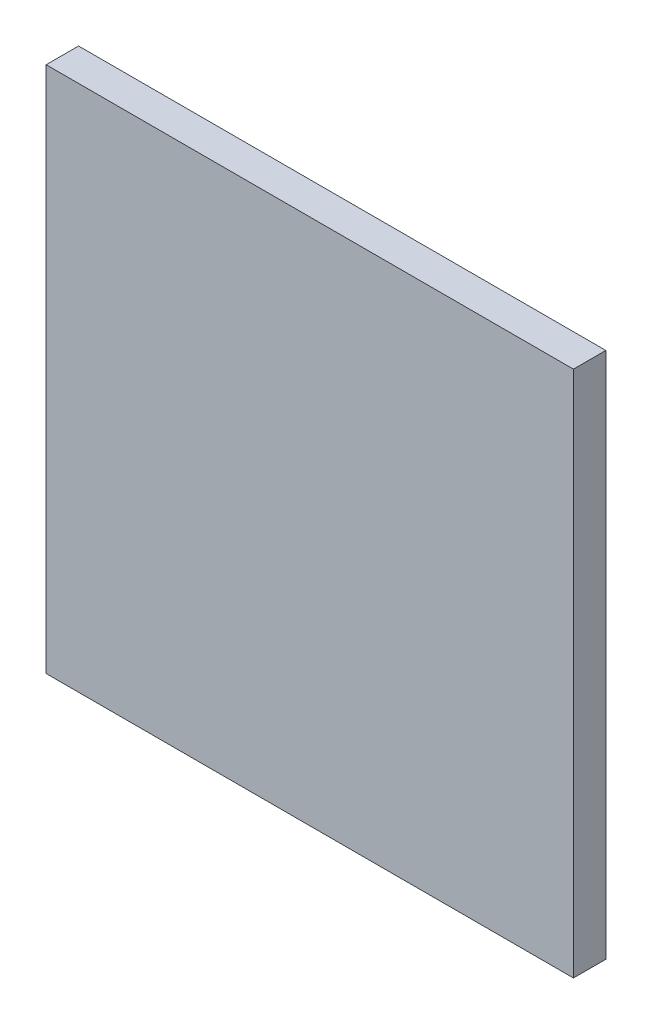
ISO-10303-21;
HEADER;
FILE_DESCRIPTION(('STEP AP214'),'2;1');
FILE_NAME('part.step','',(''),(''),'','','');
FILE_SCHEMA(('AUTOMOTIVE_DESIGN { 1 0 10303 214 1 1 1 1 }'));
ENDSEC;
DATA;
#1=APPLICATION_CONTEXT('core data for automotive mechanical design processes');
#2=APPLICATION_PROTOCOL_DEFINITION('international standard','automotive_design',2000,#1);
#3=PRODUCT_CONTEXT('',#1,'mechanical');
#4=PRODUCT('Part','Part','',(#3));
#5=PRODUCT_RELATED_PRODUCT_CATEGORY('part','',(#4));
#6=PRODUCT_DEFINITION_FORMATION('','',#4);
#7=PRODUCT_DEFINITION_CONTEXT('part definition',#1,'design');
#8=PRODUCT_DEFINITION('design','',#6,#7);
#9=PRODUCT_DEFINITION_SHAPE('','',#8);
#10=(LENGTH_UNIT() NAMED_UNIT(*) SI_UNIT(.MILLI.,.METRE.));
#11=(NAMED_UNIT(*) PLANE_ANGLE_UNIT() SI_UNIT($,.RADIAN.));
#12=(NAMED_UNIT(*) SI_UNIT($,.STERADIAN.) SOLID_ANGLE_UNIT());
#13=UNCERTAINTY_MEASURE_WITH_UNIT(LENGTH_MEASURE(1.E-05),#10,'distance_accuracy_value','');
#14=(GEOMETRIC_REPRESENTATION_CONTEXT(3) GLOBAL_UNCERTAINTY_ASSIGNED_CONTEXT((#13)) GLOBAL_UNIT_ASSIGNED_CONTEXT((#10,
#11,#12)) REPRESENTATION_CONTEXT('',''));
#15=CARTESIAN_POINT('',(0.,0.,0.));
#16=DIRECTION('',(0.,0.,1.));
#17=DIRECTION('',(1.,0.,0.));
#18=AXIS2_PLACEMENT_3D('',#15,#16,#17);
#19=CARTESIAN_POINT('',(-24.405,-24.405,3.));
#20=DIRECTION('',(1.,0.,0.));
#21=DIRECTION('',(0.,1.,0.));
#22=AXIS2_PLACEMENT_3D('',#19,#20,#21);
#23=PLANE('',#22);
#24=DIRECTION('',(0.,-1.,0.));
#25=VECTOR('',#24,1.);
#26=CARTESIAN_POINT('',(-24.405,-24.405,0.));
#27=LINE('',#26,#25);
#28=CARTESIAN_POINT('',(-24.405,24.405,0.));
#29=VERTEX_POINT('',#28);
#30=CARTESIAN_POINT('',(-24.405,-24.405,0.));
#31=VERTEX_POINT('',#30);
#32=EDGE_CURVE('E102',#29,#31,#27,.T.);
#33=ORIENTED_EDGE('',*,*,#32,.T.);
#34=DIRECTION('',(0.,0.,-1.));
#35=VECTOR('',#34,1.);
#36=CARTESIAN_POINT('',(-24.405,-24.405,3.));
#37=LINE('',#36,#35);
#38=CARTESIAN_POINT('',(-24.405,-24.405,3.));
#39=VERTEX_POINT('',#38);
#40=EDGE_CURVE('E11',#39,#31,#37,.T.);
#41=ORIENTED_EDGE('',*,*,#40,.F.);
#42=DIRECTION('',(0.,-1.,0.));
#43=VECTOR('',#42,1.);
#44=CARTESIAN_POINT('',(-24.405,-24.405,3.));
#45=LINE('',#44,#43);
#46=CARTESIAN_POINT('',(-24.405,24.405,3.));
#47=VERTEX_POINT('',#46);
#48=EDGE_CURVE('E90',#47,#39,#45,.T.);
#49=ORIENTED_EDGE('',*,*,#48,.F.);
#50=DIRECTION('',(0.,0.,-1.));
#51=VECTOR('',#50,1.);
#52=CARTESIAN_POINT('',(-24.405,24.405,3.));
#53=LINE('',#52,#51);
#54=EDGE_CURVE('E98',#47,#29,#53,.T.);
#55=ORIENTED_EDGE('',*,*,#54,.T.);
#56=EDGE_LOOP('',(#33,#41,#49,#55));
#57=FACE_BOUND('',#56,.T.);
#58=ADVANCED_FACE('F39',(#57),#23,.F.);
#59=CARTESIAN_POINT('',(24.405,-24.405,3.));
#60=DIRECTION('',(0.,1.,0.));
#61=DIRECTION('',(-1.,0.,0.));
#62=AXIS2_PLACEMENT_3D('',#59,#60,#61);
#63=PLANE('',#62);
#64=DIRECTION('',(1.,0.,0.));
#65=VECTOR('',#64,1.);
#66=CARTESIAN_POINT('',(24.405,-24.405,0.));
#67=LINE('',#66,#65);
#68=CARTESIAN_POINT('',(24.405,-24.405,0.));
#69=VERTEX_POINT('',#68);
#70=EDGE_CURVE('E94',#31,#69,#67,.T.);
#71=ORIENTED_EDGE('',*,*,#70,.T.);
#72=DIRECTION('',(0.,0.,-1.));
#73=VECTOR('',#72,1.);
#74=CARTESIAN_POINT('',(24.405,-24.405,3.));
#75=LINE('',#74,#73);
#76=CARTESIAN_POINT('',(24.405,-24.405,3.));
#77=VERTEX_POINT('',#76);
#78=EDGE_CURVE('E47',#77,#69,#75,.T.);
#79=ORIENTED_EDGE('',*,*,#78,.F.);
#80=DIRECTION('',(1.,0.,0.));
#81=VECTOR('',#80,1.);
#82=CARTESIAN_POINT('',(24.405,-24.405,3.));
#83=LINE('',#82,#81);
#84=EDGE_CURVE('E85',#39,#77,#83,.T.);
#85=ORIENTED_EDGE('',*,*,#84,.F.);
#86=ORIENTED_EDGE('',*,*,#40,.T.);
#87=EDGE_LOOP('',(#71,#79,#85,#86));
#88=FACE_BOUND('',#87,.T.);
#89=ADVANCED_FACE('F93',(#88),#63,.F.);
#90=CARTESIAN_POINT('',(24.405,24.405,3.));
#91=DIRECTION('',(-1.,0.,0.));
#92=DIRECTION('',(0.,-1.,0.));
#93=AXIS2_PLACEMENT_3D('',#90,#91,#92);
#94=PLANE('',#93);
#95=DIRECTION('',(0.,1.,0.));
#96=VECTOR('',#95,1.);
#97=CARTESIAN_POINT('',(24.405,24.405,0.));
#98=LINE('',#97,#96);
#99=CARTESIAN_POINT('',(24.405,24.405,0.));
#100=VERTEX_POINT('',#99);
#101=EDGE_CURVE('E72',#69,#100,#98,.T.);
#102=ORIENTED_EDGE('',*,*,#101,.T.);
#103=DIRECTION('',(0.,0.,-1.));
#104=VECTOR('',#103,1.);
#105=CARTESIAN_POINT('',(24.405,24.405,3.));
#106=LINE('',#105,#104);
#107=CARTESIAN_POINT('',(24.405,24.405,3.));
#108=VERTEX_POINT('',#107);
#109=EDGE_CURVE('E95',#108,#100,#106,.T.);
#110=ORIENTED_EDGE('',*,*,#109,.F.);
#111=DIRECTION('',(0.,1.,0.));
#112=VECTOR('',#111,1.);
#113=CARTESIAN_POINT('',(24.405,24.405,3.));
#114=LINE('',#113,#112);
#115=EDGE_CURVE('E88',#77,#108,#114,.T.);
#116=ORIENTED_EDGE('',*,*,#115,.F.);
#117=ORIENTED_EDGE('',*,*,#78,.T.);
#118=EDGE_LOOP('',(#102,#110,#116,#117));
#119=FACE_BOUND('',#118,.T.);
#120=ADVANCED_FACE('F96',(#119),#94,.F.);
#121=CARTESIAN_POINT('',(-24.405,24.405,3.));
#122=DIRECTION('',(0.,-1.,0.));
#123=DIRECTION('',(1.,0.,0.));
#124=AXIS2_PLACEMENT_3D('',#121,#122,#123);
#125=PLANE('',#124);
#126=DIRECTION('',(-1.,0.,0.));
#127=VECTOR('',#126,1.);
#128=CARTESIAN_POINT('',(-24.405,24.405,0.));
#129=LINE('',#128,#127);
#130=EDGE_CURVE('E78',#100,#29,#129,.T.);
#131=ORIENTED_EDGE('',*,*,#130,.T.);
#132=ORIENTED_EDGE('',*,*,#54,.F.);
#133=DIRECTION('',(-1.,0.,0.));
#134=VECTOR('',#133,1.);
#135=CARTESIAN_POINT('',(-24.405,24.405,3.));
#136=LINE('',#135,#134);
#137=EDGE_CURVE('E55',#108,#47,#136,.T.);
#138=ORIENTED_EDGE('',*,*,#137,.F.);
#139=ORIENTED_EDGE('',*,*,#109,.T.);
#140=EDGE_LOOP('',(#131,#132,#138,#139));
#141=FACE_BOUND('',#140,.T.);
#142=ADVANCED_FACE('F109',(#141),#125,.F.);
#143=CARTESIAN_POINT('',(0.,0.,3.));
#144=DIRECTION('',(0.,0.,-1.));
#145=DIRECTION('',(-1.,0.,0.));
#146=AXIS2_PLACEMENT_3D('',#143,#144,#145);
#147=PLANE('',#146);
#148=ORIENTED_EDGE('',*,*,#48,.T.);
#149=ORIENTED_EDGE('',*,*,#84,.T.);
#150=ORIENTED_EDGE('',*,*,#115,.T.);
#151=ORIENTED_EDGE('',*,*,#137,.T.);
#152=EDGE_LOOP('',(#148,#149,#150,#151));
#153=FACE_BOUND('',#152,.T.);
#154=ADVANCED_FACE('F86',(#153),#147,.F.);
#155=CARTESIAN_POINT('',(0.,0.,0.));
#156=DIRECTION('',(0.,0.,-1.));
#157=DIRECTION('',(-1.,0.,0.));
#158=AXIS2_PLACEMENT_3D('',#155,#156,#157);
#159=PLANE('',#158);
#160=ORIENTED_EDGE('',*,*,#32,.F.);
#161=ORIENTED_EDGE('',*,*,#130,.F.);
#162=ORIENTED_EDGE('',*,*,#101,.F.);
#163=ORIENTED_EDGE('',*,*,#70,.F.);
#164=EDGE_LOOP('',(#160,#161,#162,#163));
#165=FACE_BOUND('',#164,.T.);
#166=ADVANCED_FACE('F112',(#165),#159,.T.);
#167=CLOSED_SHELL('',(#58,#89,#120,#142,#154,#166));
#168=MANIFOLD_SOLID_BREP('B2',#167);
#169=ADVANCED_BREP_SHAPE_REPRESENTATION('',(#18,#168),#14);
#170=SHAPE_DEFINITION_REPRESENTATION(#9,#169);
ENDSEC;
END-ISO-10303-21;
